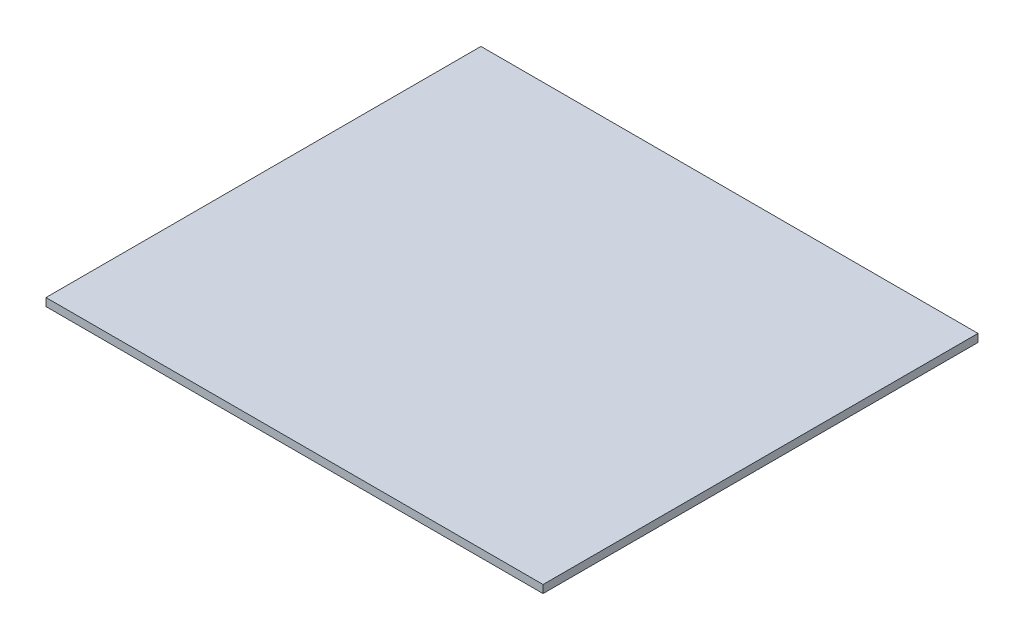
ISO-10303-21;
HEADER;
FILE_DESCRIPTION(('STEP AP214'),'2;1');
FILE_NAME('part.step','',(''),(''),'','','');
FILE_SCHEMA(('AUTOMOTIVE_DESIGN { 1 0 10303 214 1 1 1 1 }'));
ENDSEC;
DATA;
#1=APPLICATION_CONTEXT('core data for automotive mechanical design processes');
#2=APPLICATION_PROTOCOL_DEFINITION('international standard','automotive_design',2000,#1);
#3=PRODUCT_CONTEXT('',#1,'mechanical');
#4=PRODUCT('Part','Part','',(#3));
#5=PRODUCT_RELATED_PRODUCT_CATEGORY('part','',(#4));
#6=PRODUCT_DEFINITION_FORMATION('','',#4);
#7=PRODUCT_DEFINITION_CONTEXT('part definition',#1,'design');
#8=PRODUCT_DEFINITION('design','',#6,#7);
#9=PRODUCT_DEFINITION_SHAPE('','',#8);
#10=(LENGTH_UNIT() NAMED_UNIT(*) SI_UNIT(.MILLI.,.METRE.));
#11=(NAMED_UNIT(*) PLANE_ANGLE_UNIT() SI_UNIT($,.RADIAN.));
#12=(NAMED_UNIT(*) SI_UNIT($,.STERADIAN.) SOLID_ANGLE_UNIT());
#13=UNCERTAINTY_MEASURE_WITH_UNIT(LENGTH_MEASURE(1.E-05),#10,'distance_accuracy_value','');
#14=(GEOMETRIC_REPRESENTATION_CONTEXT(3) GLOBAL_UNCERTAINTY_ASSIGNED_CONTEXT((#13)) GLOBAL_UNIT_ASSIGNED_CONTEXT((#10,
#11,#12)) REPRESENTATION_CONTEXT('',''));
#15=CARTESIAN_POINT('',(0.,0.,0.));
#16=DIRECTION('',(0.,0.,1.));
#17=DIRECTION('',(1.,0.,0.));
#18=AXIS2_PLACEMENT_3D('',#15,#16,#17);
#19=CARTESIAN_POINT('',(0.,6.35,0.));
#20=DIRECTION('',(1.,0.,0.));
#21=DIRECTION('',(0.,0.,-1.));
#22=AXIS2_PLACEMENT_3D('',#19,#20,#21);
#23=PLANE('',#22);
#24=DIRECTION('',(0.,0.,1.));
#25=VECTOR('',#24,1.);
#26=CARTESIAN_POINT('',(0.,0.,0.));
#27=LINE('',#26,#25);
#28=CARTESIAN_POINT('',(0.,0.,-350.));
#29=VERTEX_POINT('',#28);
#30=CARTESIAN_POINT('',(0.,0.,0.));
#31=VERTEX_POINT('',#30);
#32=EDGE_CURVE('E106',#29,#31,#27,.T.);
#33=ORIENTED_EDGE('',*,*,#32,.T.);
#34=DIRECTION('',(0.,-1.,0.));
#35=VECTOR('',#34,1.);
#36=CARTESIAN_POINT('',(0.,6.35,0.));
#37=LINE('',#36,#35);
#38=CARTESIAN_POINT('',(0.,6.35,0.));
#39=VERTEX_POINT('',#38);
#40=EDGE_CURVE('E11',#39,#31,#37,.T.);
#41=ORIENTED_EDGE('',*,*,#40,.F.);
#42=DIRECTION('',(0.,0.,1.));
#43=VECTOR('',#42,1.);
#44=CARTESIAN_POINT('',(0.,6.35,0.));
#45=LINE('',#44,#43);
#46=CARTESIAN_POINT('',(0.,6.35,-350.));
#47=VERTEX_POINT('',#46);
#48=EDGE_CURVE('E94',#47,#39,#45,.T.);
#49=ORIENTED_EDGE('',*,*,#48,.F.);
#50=DIRECTION('',(0.,-1.,0.));
#51=VECTOR('',#50,1.);
#52=CARTESIAN_POINT('',(0.,6.35,-350.));
#53=LINE('',#52,#51);
#54=EDGE_CURVE('E102',#47,#29,#53,.T.);
#55=ORIENTED_EDGE('',*,*,#54,.T.);
#56=EDGE_LOOP('',(#33,#41,#49,#55));
#57=FACE_BOUND('',#56,.T.);
#58=ADVANCED_FACE('F43',(#57),#23,.F.);
#59=CARTESIAN_POINT('',(0.,6.35,0.));
#60=DIRECTION('',(0.,0.,-1.));
#61=DIRECTION('',(-1.,0.,0.));
#62=AXIS2_PLACEMENT_3D('',#59,#60,#61);
#63=PLANE('',#62);
#64=DIRECTION('',(1.,0.,0.));
#65=VECTOR('',#64,1.);
#66=CARTESIAN_POINT('',(0.,0.,0.));
#67=LINE('',#66,#65);
#68=CARTESIAN_POINT('',(400.,0.,0.));
#69=VERTEX_POINT('',#68);
#70=EDGE_CURVE('E98',#31,#69,#67,.T.);
#71=ORIENTED_EDGE('',*,*,#70,.T.);
#72=DIRECTION('',(0.,-1.,0.));
#73=VECTOR('',#72,1.);
#74=CARTESIAN_POINT('',(400.,6.35,0.));
#75=LINE('',#74,#73);
#76=CARTESIAN_POINT('',(400.,6.35,0.));
#77=VERTEX_POINT('',#76);
#78=EDGE_CURVE('E51',#77,#69,#75,.T.);
#79=ORIENTED_EDGE('',*,*,#78,.F.);
#80=DIRECTION('',(1.,0.,0.));
#81=VECTOR('',#80,1.);
#82=CARTESIAN_POINT('',(0.,6.35,0.));
#83=LINE('',#82,#81);
#84=EDGE_CURVE('E89',#39,#77,#83,.T.);
#85=ORIENTED_EDGE('',*,*,#84,.F.);
#86=ORIENTED_EDGE('',*,*,#40,.T.);
#87=EDGE_LOOP('',(#71,#79,#85,#86));
#88=FACE_BOUND('',#87,.T.);
#89=ADVANCED_FACE('F97',(#88),#63,.F.);
#90=CARTESIAN_POINT('',(400.,6.35,0.));
#91=DIRECTION('',(-1.,0.,0.));
#92=DIRECTION('',(0.,0.,1.));
#93=AXIS2_PLACEMENT_3D('',#90,#91,#92);
#94=PLANE('',#93);
#95=DIRECTION('',(0.,0.,-1.));
#96=VECTOR('',#95,1.);
#97=CARTESIAN_POINT('',(400.,0.,0.));
#98=LINE('',#97,#96);
#99=CARTESIAN_POINT('',(400.,0.,-350.));
#100=VERTEX_POINT('',#99);
#101=EDGE_CURVE('E76',#69,#100,#98,.T.);
#102=ORIENTED_EDGE('',*,*,#101,.T.);
#103=DIRECTION('',(0.,-1.,0.));
#104=VECTOR('',#103,1.);
#105=CARTESIAN_POINT('',(400.,6.35,-350.));
#106=LINE('',#105,#104);
#107=CARTESIAN_POINT('',(400.,6.35,-350.));
#108=VERTEX_POINT('',#107);
#109=EDGE_CURVE('E99',#108,#100,#106,.T.);
#110=ORIENTED_EDGE('',*,*,#109,.F.);
#111=DIRECTION('',(0.,0.,-1.));
#112=VECTOR('',#111,1.);
#113=CARTESIAN_POINT('',(400.,6.35,0.));
#114=LINE('',#113,#112);
#115=EDGE_CURVE('E92',#77,#108,#114,.T.);
#116=ORIENTED_EDGE('',*,*,#115,.F.);
#117=ORIENTED_EDGE('',*,*,#78,.T.);
#118=EDGE_LOOP('',(#102,#110,#116,#117));
#119=FACE_BOUND('',#118,.T.);
#120=ADVANCED_FACE('F100',(#119),#94,.F.);
#121=CARTESIAN_POINT('',(0.,6.35,-350.));
#122=DIRECTION('',(0.,0.,1.));
#123=DIRECTION('',(1.,0.,0.));
#124=AXIS2_PLACEMENT_3D('',#121,#122,#123);
#125=PLANE('',#124);
#126=DIRECTION('',(-1.,0.,0.));
#127=VECTOR('',#126,1.);
#128=CARTESIAN_POINT('',(0.,0.,-350.));
#129=LINE('',#128,#127);
#130=EDGE_CURVE('E82',#100,#29,#129,.T.);
#131=ORIENTED_EDGE('',*,*,#130,.T.);
#132=ORIENTED_EDGE('',*,*,#54,.F.);
#133=DIRECTION('',(-1.,0.,0.));
#134=VECTOR('',#133,1.);
#135=CARTESIAN_POINT('',(0.,6.35,-350.));
#136=LINE('',#135,#134);
#137=EDGE_CURVE('E59',#108,#47,#136,.T.);
#138=ORIENTED_EDGE('',*,*,#137,.F.);
#139=ORIENTED_EDGE('',*,*,#109,.T.);
#140=EDGE_LOOP('',(#131,#132,#138,#139));
#141=FACE_BOUND('',#140,.T.);
#142=ADVANCED_FACE('F113',(#141),#125,.F.);
#143=CARTESIAN_POINT('',(0.,6.35,0.));
#144=DIRECTION('',(0.,-1.,0.));
#145=DIRECTION('',(0.,0.,-1.));
#146=AXIS2_PLACEMENT_3D('',#143,#144,#145);
#147=PLANE('',#146);
#148=ORIENTED_EDGE('',*,*,#48,.T.);
#149=ORIENTED_EDGE('',*,*,#84,.T.);
#150=ORIENTED_EDGE('',*,*,#115,.T.);
#151=ORIENTED_EDGE('',*,*,#137,.T.);
#152=EDGE_LOOP('',(#148,#149,#150,#151));
#153=FACE_BOUND('',#152,.T.);
#154=ADVANCED_FACE('F90',(#153),#147,.F.);
#155=CARTESIAN_POINT('',(0.,0.,0.));
#156=DIRECTION('',(0.,-1.,0.));
#157=DIRECTION('',(0.,0.,-1.));
#158=AXIS2_PLACEMENT_3D('',#155,#156,#157);
#159=PLANE('',#158);
#160=ORIENTED_EDGE('',*,*,#32,.F.);
#161=ORIENTED_EDGE('',*,*,#130,.F.);
#162=ORIENTED_EDGE('',*,*,#101,.F.);
#163=ORIENTED_EDGE('',*,*,#70,.F.);
#164=EDGE_LOOP('',(#160,#161,#162,#163));
#165=FACE_BOUND('',#164,.T.);
#166=ADVANCED_FACE('F116',(#165),#159,.T.);
#167=CLOSED_SHELL('',(#58,#89,#120,#142,#154,#166));
#168=MANIFOLD_SOLID_BREP('B2',#167);
#169=ADVANCED_BREP_SHAPE_REPRESENTATION('',(#18,#168),#14);
#170=SHAPE_DEFINITION_REPRESENTATION(#9,#169);
ENDSEC;
END-ISO-10303-21;
